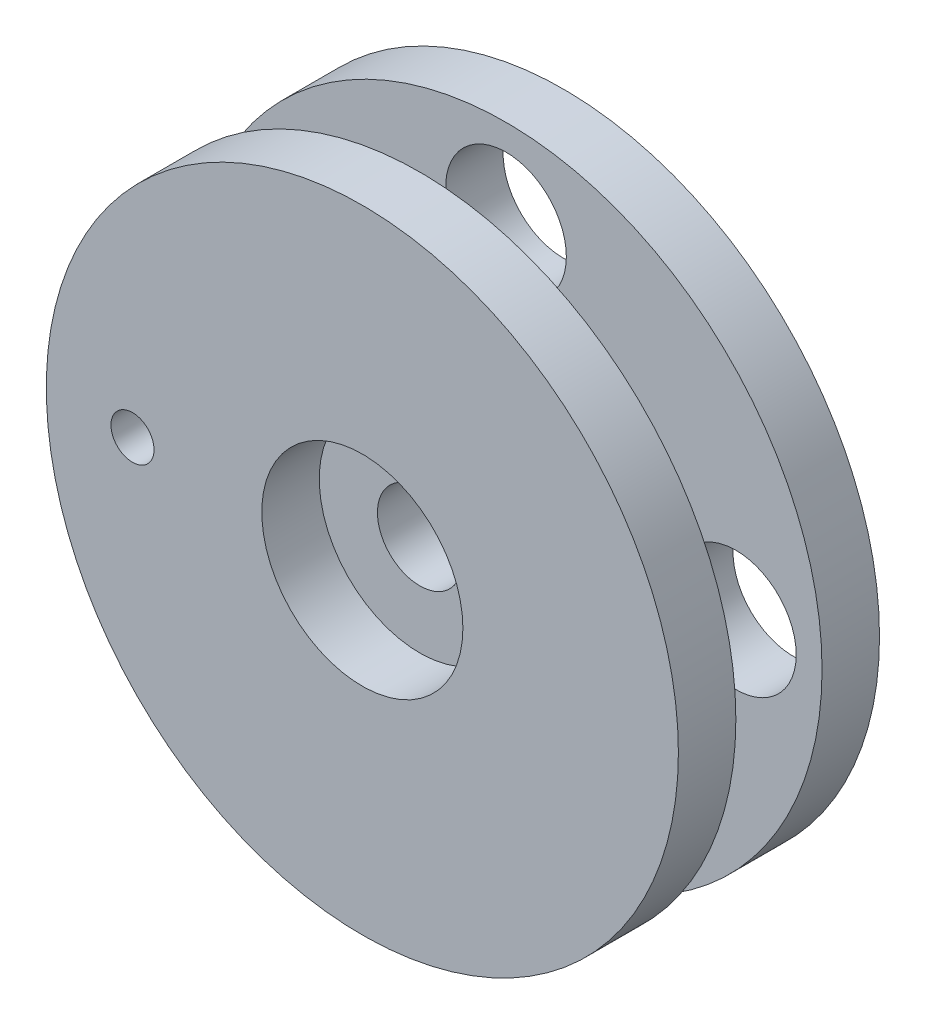
ISO-10303-21;
HEADER;
FILE_DESCRIPTION(('STEP AP214'),'2;1');
FILE_NAME('part.step','',(''),(''),'','','');
FILE_SCHEMA(('AUTOMOTIVE_DESIGN { 1 0 10303 214 1 1 1 1 }'));
ENDSEC;
DATA;
#1=APPLICATION_CONTEXT('core data for automotive mechanical design processes');
#2=APPLICATION_PROTOCOL_DEFINITION('international standard','automotive_design',2000,#1);
#3=PRODUCT_CONTEXT('',#1,'mechanical');
#4=PRODUCT('Part','Part','',(#3));
#5=PRODUCT_RELATED_PRODUCT_CATEGORY('part','',(#4));
#6=PRODUCT_DEFINITION_FORMATION('','',#4);
#7=PRODUCT_DEFINITION_CONTEXT('part definition',#1,'design');
#8=PRODUCT_DEFINITION('design','',#6,#7);
#9=PRODUCT_DEFINITION_SHAPE('','',#8);
#10=(LENGTH_UNIT() NAMED_UNIT(*) SI_UNIT(.MILLI.,.METRE.));
#11=(NAMED_UNIT(*) PLANE_ANGLE_UNIT() SI_UNIT($,.RADIAN.));
#12=(NAMED_UNIT(*) SI_UNIT($,.STERADIAN.) SOLID_ANGLE_UNIT());
#13=UNCERTAINTY_MEASURE_WITH_UNIT(LENGTH_MEASURE(1.E-05),#10,'distance_accuracy_value','');
#14=(GEOMETRIC_REPRESENTATION_CONTEXT(3) GLOBAL_UNCERTAINTY_ASSIGNED_CONTEXT((#13)) GLOBAL_UNIT_ASSIGNED_CONTEXT((#10,
#11,#12)) REPRESENTATION_CONTEXT('',''));
#15=CARTESIAN_POINT('',(0.,0.,0.));
#16=DIRECTION('',(0.,0.,1.));
#17=DIRECTION('',(1.,0.,0.));
#18=AXIS2_PLACEMENT_3D('',#15,#16,#17);
#19=CARTESIAN_POINT('',(0.,0.,2.));
#20=DIRECTION('',(0.,0.,1.));
#21=DIRECTION('',(1.,0.,0.));
#22=AXIS2_PLACEMENT_3D('',#19,#20,#21);
#23=PLANE('',#22);
#24=CARTESIAN_POINT('',(0.,-8.,2.));
#25=DIRECTION('',(0.,0.,1.));
#26=DIRECTION('',(1.,0.,0.));
#27=AXIS2_PLACEMENT_3D('',#24,#25,#26);
#28=CIRCLE('',#27,2.1);
#29=CARTESIAN_POINT('',(2.1,-8.,2.));
#30=VERTEX_POINT('',#29);
#31=EDGE_CURVE('E67',#30,#30,#28,.T.);
#32=ORIENTED_EDGE('',*,*,#31,.F.);
#33=EDGE_LOOP('',(#32));
#34=FACE_BOUND('',#33,.T.);
#35=CARTESIAN_POINT('',(0.,8.,2.));
#36=DIRECTION('',(0.,0.,1.));
#37=DIRECTION('',(1.,0.,0.));
#38=AXIS2_PLACEMENT_3D('',#35,#36,#37);
#39=CIRCLE('',#38,2.1);
#40=CARTESIAN_POINT('',(2.1,8.,2.));
#41=VERTEX_POINT('',#40);
#42=EDGE_CURVE('E55',#41,#41,#39,.T.);
#43=ORIENTED_EDGE('',*,*,#42,.F.);
#44=EDGE_LOOP('',(#43));
#45=FACE_BOUND('',#44,.T.);
#46=CARTESIAN_POINT('',(0.,0.,2.));
#47=DIRECTION('',(0.,0.,1.));
#48=DIRECTION('',(1.,0.,0.));
#49=AXIS2_PLACEMENT_3D('',#46,#47,#48);
#50=CIRCLE('',#49,11.);
#51=CARTESIAN_POINT('',(11.,0.,2.));
#52=VERTEX_POINT('',#51);
#53=EDGE_CURVE('E38',#52,#52,#50,.T.);
#54=ORIENTED_EDGE('',*,*,#53,.T.);
#55=EDGE_LOOP('',(#54));
#56=FACE_BOUND('',#55,.T.);
#57=CARTESIAN_POINT('',(-8.,0.,2.));
#58=DIRECTION('',(0.,0.,1.));
#59=DIRECTION('',(1.,0.,0.));
#60=AXIS2_PLACEMENT_3D('',#57,#58,#59);
#61=CIRCLE('',#60,2.1);
#62=CARTESIAN_POINT('',(-5.9,0.,2.));
#63=VERTEX_POINT('',#62);
#64=EDGE_CURVE('E51',#63,#63,#61,.T.);
#65=ORIENTED_EDGE('',*,*,#64,.F.);
#66=EDGE_LOOP('',(#65));
#67=FACE_BOUND('',#66,.T.);
#68=CARTESIAN_POINT('',(8.,0.,2.));
#69=DIRECTION('',(0.,0.,1.));
#70=DIRECTION('',(1.,0.,0.));
#71=AXIS2_PLACEMENT_3D('',#68,#69,#70);
#72=CIRCLE('',#71,2.1);
#73=CARTESIAN_POINT('',(10.1,0.,2.));
#74=VERTEX_POINT('',#73);
#75=EDGE_CURVE('E61',#74,#74,#72,.T.);
#76=ORIENTED_EDGE('',*,*,#75,.F.);
#77=EDGE_LOOP('',(#76));
#78=FACE_BOUND('',#77,.T.);
#79=CARTESIAN_POINT('',(0.,0.,2.));
#80=DIRECTION('',(0.,0.,1.));
#81=DIRECTION('',(1.,0.,0.));
#82=AXIS2_PLACEMENT_3D('',#79,#80,#81);
#83=CIRCLE('',#82,5.);
#84=CARTESIAN_POINT('',(5.,0.,2.));
#85=VERTEX_POINT('',#84);
#86=EDGE_CURVE('E76',#85,#85,#83,.T.);
#87=ORIENTED_EDGE('',*,*,#86,.F.);
#88=EDGE_LOOP('',(#87));
#89=FACE_BOUND('',#88,.T.);
#90=ADVANCED_FACE('F31',(#34,#45,#56,#67,#78,#89),#23,.T.);
#91=CARTESIAN_POINT('',(0.,0.,0.));
#92=DIRECTION('',(0.,0.,1.));
#93=DIRECTION('',(1.,0.,0.));
#94=AXIS2_PLACEMENT_3D('',#91,#92,#93);
#95=PLANE('',#94);
#96=CARTESIAN_POINT('',(8.,0.,0.));
#97=DIRECTION('',(0.,0.,1.));
#98=DIRECTION('',(1.,0.,0.));
#99=AXIS2_PLACEMENT_3D('',#96,#97,#98);
#100=CIRCLE('',#99,2.1);
#101=CARTESIAN_POINT('',(10.1,0.,0.));
#102=VERTEX_POINT('',#101);
#103=EDGE_CURVE('E64',#102,#102,#100,.T.);
#104=ORIENTED_EDGE('',*,*,#103,.T.);
#105=EDGE_LOOP('',(#104));
#106=FACE_BOUND('',#105,.T.);
#107=CARTESIAN_POINT('',(-8.,0.,0.));
#108=DIRECTION('',(0.,0.,1.));
#109=DIRECTION('',(1.,0.,0.));
#110=AXIS2_PLACEMENT_3D('',#107,#108,#109);
#111=CIRCLE('',#110,2.1);
#112=CARTESIAN_POINT('',(-5.9,0.,0.));
#113=VERTEX_POINT('',#112);
#114=EDGE_CURVE('E52',#113,#113,#111,.T.);
#115=ORIENTED_EDGE('',*,*,#114,.T.);
#116=EDGE_LOOP('',(#115));
#117=FACE_BOUND('',#116,.T.);
#118=CARTESIAN_POINT('',(0.,0.,0.));
#119=DIRECTION('',(0.,0.,1.));
#120=DIRECTION('',(1.,0.,0.));
#121=AXIS2_PLACEMENT_3D('',#118,#119,#120);
#122=CIRCLE('',#121,11.);
#123=CARTESIAN_POINT('',(11.,0.,0.));
#124=VERTEX_POINT('',#123);
#125=EDGE_CURVE('E42',#124,#124,#122,.T.);
#126=ORIENTED_EDGE('',*,*,#125,.F.);
#127=EDGE_LOOP('',(#126));
#128=FACE_BOUND('',#127,.T.);
#129=CARTESIAN_POINT('',(0.,0.,0.));
#130=DIRECTION('',(0.,0.,1.));
#131=DIRECTION('',(1.,0.,0.));
#132=AXIS2_PLACEMENT_3D('',#129,#130,#131);
#133=CIRCLE('',#132,1.475);
#134=CARTESIAN_POINT('',(1.475,0.,0.));
#135=VERTEX_POINT('',#134);
#136=EDGE_CURVE('E47',#135,#135,#133,.T.);
#137=ORIENTED_EDGE('',*,*,#136,.T.);
#138=EDGE_LOOP('',(#137));
#139=FACE_BOUND('',#138,.T.);
#140=CARTESIAN_POINT('',(0.,8.,0.));
#141=DIRECTION('',(0.,0.,1.));
#142=DIRECTION('',(1.,0.,0.));
#143=AXIS2_PLACEMENT_3D('',#140,#141,#142);
#144=CIRCLE('',#143,2.1);
#145=CARTESIAN_POINT('',(2.1,8.,0.));
#146=VERTEX_POINT('',#145);
#147=EDGE_CURVE('E58',#146,#146,#144,.T.);
#148=ORIENTED_EDGE('',*,*,#147,.T.);
#149=EDGE_LOOP('',(#148));
#150=FACE_BOUND('',#149,.T.);
#151=CARTESIAN_POINT('',(0.,-8.,0.));
#152=DIRECTION('',(0.,0.,1.));
#153=DIRECTION('',(1.,0.,0.));
#154=AXIS2_PLACEMENT_3D('',#151,#152,#153);
#155=CIRCLE('',#154,2.1);
#156=CARTESIAN_POINT('',(2.1,-8.,0.));
#157=VERTEX_POINT('',#156);
#158=EDGE_CURVE('E70',#157,#157,#155,.T.);
#159=ORIENTED_EDGE('',*,*,#158,.T.);
#160=EDGE_LOOP('',(#159));
#161=FACE_BOUND('',#160,.T.);
#162=ADVANCED_FACE('F123',(#106,#117,#128,#139,#150,#161),#95,.F.);
#163=CARTESIAN_POINT('',(0.,0.,2.));
#164=DIRECTION('',(0.,0.,-1.));
#165=DIRECTION('',(-1.,0.,0.));
#166=AXIS2_PLACEMENT_3D('',#163,#164,#165);
#167=CYLINDRICAL_SURFACE('',#166,11.);
#168=ORIENTED_EDGE('',*,*,#53,.F.);
#169=EDGE_LOOP('',(#168));
#170=FACE_BOUND('',#169,.T.);
#171=ORIENTED_EDGE('',*,*,#125,.T.);
#172=EDGE_LOOP('',(#171));
#173=FACE_BOUND('',#172,.T.);
#174=ADVANCED_FACE('F33',(#170,#173),#167,.T.);
#175=CARTESIAN_POINT('',(0.,0.,2.));
#176=DIRECTION('',(0.,0.,-1.));
#177=DIRECTION('',(-1.,0.,0.));
#178=AXIS2_PLACEMENT_3D('',#175,#176,#177);
#179=CYLINDRICAL_SURFACE('',#178,1.475);
#180=ORIENTED_EDGE('',*,*,#136,.F.);
#181=EDGE_LOOP('',(#180));
#182=FACE_BOUND('',#181,.T.);
#183=CARTESIAN_POINT('',(0.,0.,5.));
#184=DIRECTION('',(0.,0.,1.));
#185=DIRECTION('',(1.,0.,0.));
#186=AXIS2_PLACEMENT_3D('',#183,#184,#185);
#187=CIRCLE('',#186,1.475);
#188=CARTESIAN_POINT('',(1.475,0.,5.));
#189=VERTEX_POINT('',#188);
#190=EDGE_CURVE('E79',#189,#189,#187,.T.);
#191=ORIENTED_EDGE('',*,*,#190,.T.);
#192=EDGE_LOOP('',(#191));
#193=FACE_BOUND('',#192,.T.);
#194=ADVANCED_FACE('F133',(#182,#193),#179,.F.);
#195=CARTESIAN_POINT('',(-8.,0.,2.));
#196=DIRECTION('',(0.,0.,-1.));
#197=DIRECTION('',(-1.,0.,0.));
#198=AXIS2_PLACEMENT_3D('',#195,#196,#197);
#199=CYLINDRICAL_SURFACE('',#198,2.1);
#200=ORIENTED_EDGE('',*,*,#64,.T.);
#201=EDGE_LOOP('',(#200));
#202=FACE_BOUND('',#201,.T.);
#203=ORIENTED_EDGE('',*,*,#114,.F.);
#204=EDGE_LOOP('',(#203));
#205=FACE_BOUND('',#204,.T.);
#206=ADVANCED_FACE('F136',(#202,#205),#199,.F.);
#207=CARTESIAN_POINT('',(0.,8.,2.));
#208=DIRECTION('',(0.,0.,-1.));
#209=DIRECTION('',(-1.,0.,0.));
#210=AXIS2_PLACEMENT_3D('',#207,#208,#209);
#211=CYLINDRICAL_SURFACE('',#210,2.1);
#212=ORIENTED_EDGE('',*,*,#42,.T.);
#213=EDGE_LOOP('',(#212));
#214=FACE_BOUND('',#213,.T.);
#215=ORIENTED_EDGE('',*,*,#147,.F.);
#216=EDGE_LOOP('',(#215));
#217=FACE_BOUND('',#216,.T.);
#218=ADVANCED_FACE('F140',(#214,#217),#211,.F.);
#219=CARTESIAN_POINT('',(8.,0.,2.));
#220=DIRECTION('',(0.,0.,-1.));
#221=DIRECTION('',(-1.,0.,0.));
#222=AXIS2_PLACEMENT_3D('',#219,#220,#221);
#223=CYLINDRICAL_SURFACE('',#222,2.1);
#224=ORIENTED_EDGE('',*,*,#75,.T.);
#225=EDGE_LOOP('',(#224));
#226=FACE_BOUND('',#225,.T.);
#227=ORIENTED_EDGE('',*,*,#103,.F.);
#228=EDGE_LOOP('',(#227));
#229=FACE_BOUND('',#228,.T.);
#230=ADVANCED_FACE('F144',(#226,#229),#223,.F.);
#231=CARTESIAN_POINT('',(0.,-8.,2.));
#232=DIRECTION('',(0.,0.,-1.));
#233=DIRECTION('',(-1.,0.,0.));
#234=AXIS2_PLACEMENT_3D('',#231,#232,#233);
#235=CYLINDRICAL_SURFACE('',#234,2.1);
#236=ORIENTED_EDGE('',*,*,#31,.T.);
#237=EDGE_LOOP('',(#236));
#238=FACE_BOUND('',#237,.T.);
#239=ORIENTED_EDGE('',*,*,#158,.F.);
#240=EDGE_LOOP('',(#239));
#241=FACE_BOUND('',#240,.T.);
#242=ADVANCED_FACE('F148',(#238,#241),#235,.F.);
#243=CARTESIAN_POINT('',(0.,0.,5.));
#244=DIRECTION('',(0.,0.,1.));
#245=DIRECTION('',(1.,0.,0.));
#246=AXIS2_PLACEMENT_3D('',#243,#244,#245);
#247=PLANE('',#246);
#248=CARTESIAN_POINT('',(0.,0.,5.));
#249=DIRECTION('',(0.,0.,1.));
#250=DIRECTION('',(1.,0.,0.));
#251=AXIS2_PLACEMENT_3D('',#248,#249,#250);
#252=CIRCLE('',#251,3.5);
#253=CARTESIAN_POINT('',(3.5,0.,5.));
#254=VERTEX_POINT('',#253);
#255=EDGE_CURVE('E10',#254,#254,#252,.F.);
#256=ORIENTED_EDGE('',*,*,#255,.F.);
#257=EDGE_LOOP('',(#256));
#258=FACE_BOUND('',#257,.T.);
#259=ORIENTED_EDGE('',*,*,#190,.F.);
#260=EDGE_LOOP('',(#259));
#261=FACE_BOUND('',#260,.T.);
#262=ADVANCED_FACE('F152',(#258,#261),#247,.T.);
#263=CARTESIAN_POINT('',(0.,0.,5.));
#264=DIRECTION('',(0.,0.,-1.));
#265=DIRECTION('',(-1.,0.,0.));
#266=AXIS2_PLACEMENT_3D('',#263,#264,#265);
#267=CYLINDRICAL_SURFACE('',#266,5.);
#268=CARTESIAN_POINT('',(0.,0.,5.));
#269=DIRECTION('',(0.,0.,1.));
#270=DIRECTION('',(1.,0.,0.));
#271=AXIS2_PLACEMENT_3D('',#268,#269,#270);
#272=CIRCLE('',#271,5.);
#273=CARTESIAN_POINT('',(5.,0.,5.));
#274=VERTEX_POINT('',#273);
#275=EDGE_CURVE('E73',#274,#274,#272,.T.);
#276=ORIENTED_EDGE('',*,*,#275,.F.);
#277=EDGE_LOOP('',(#276));
#278=FACE_BOUND('',#277,.T.);
#279=ORIENTED_EDGE('',*,*,#86,.T.);
#280=EDGE_LOOP('',(#279));
#281=FACE_BOUND('',#280,.T.);
#282=ADVANCED_FACE('F116',(#278,#281),#267,.T.);
#283=CARTESIAN_POINT('',(0.,0.,5.));
#284=DIRECTION('',(0.,0.,1.));
#285=DIRECTION('',(1.,0.,0.));
#286=AXIS2_PLACEMENT_3D('',#283,#284,#285);
#287=PLANE('',#286);
#288=CARTESIAN_POINT('',(-8.,0.,5.));
#289=DIRECTION('',(0.,0.,1.));
#290=DIRECTION('',(1.,0.,0.));
#291=AXIS2_PLACEMENT_3D('',#288,#289,#290);
#292=CIRCLE('',#291,0.75);
#293=CARTESIAN_POINT('',(-7.25,0.,5.));
#294=VERTEX_POINT('',#293);
#295=EDGE_CURVE('E94',#294,#294,#292,.T.);
#296=ORIENTED_EDGE('',*,*,#295,.T.);
#297=EDGE_LOOP('',(#296));
#298=FACE_BOUND('',#297,.T.);
#299=CARTESIAN_POINT('',(0.,0.,5.));
#300=DIRECTION('',(0.,0.,1.));
#301=DIRECTION('',(1.,0.,0.));
#302=AXIS2_PLACEMENT_3D('',#299,#300,#301);
#303=CIRCLE('',#302,11.);
#304=CARTESIAN_POINT('',(11.,0.,5.));
#305=VERTEX_POINT('',#304);
#306=EDGE_CURVE('E85',#305,#305,#303,.T.);
#307=ORIENTED_EDGE('',*,*,#306,.F.);
#308=EDGE_LOOP('',(#307));
#309=FACE_BOUND('',#308,.T.);
#310=ORIENTED_EDGE('',*,*,#275,.T.);
#311=EDGE_LOOP('',(#310));
#312=FACE_BOUND('',#311,.T.);
#313=ADVANCED_FACE('F106',(#298,#309,#312),#287,.F.);
#314=CARTESIAN_POINT('',(0.,0.,7.));
#315=DIRECTION('',(0.,0.,1.));
#316=DIRECTION('',(1.,0.,0.));
#317=AXIS2_PLACEMENT_3D('',#314,#315,#316);
#318=PLANE('',#317);
#319=CARTESIAN_POINT('',(0.,0.,7.));
#320=DIRECTION('',(0.,0.,1.));
#321=DIRECTION('',(1.,0.,0.));
#322=AXIS2_PLACEMENT_3D('',#319,#320,#321);
#323=CIRCLE('',#322,3.5);
#324=CARTESIAN_POINT('',(3.5,0.,7.));
#325=VERTEX_POINT('',#324);
#326=EDGE_CURVE('E88',#325,#325,#323,.T.);
#327=ORIENTED_EDGE('',*,*,#326,.F.);
#328=EDGE_LOOP('',(#327));
#329=FACE_BOUND('',#328,.T.);
#330=CARTESIAN_POINT('',(0.,0.,7.));
#331=DIRECTION('',(0.,0.,1.));
#332=DIRECTION('',(1.,0.,0.));
#333=AXIS2_PLACEMENT_3D('',#330,#331,#332);
#334=CIRCLE('',#333,11.);
#335=CARTESIAN_POINT('',(11.,0.,7.));
#336=VERTEX_POINT('',#335);
#337=EDGE_CURVE('E84',#336,#336,#334,.T.);
#338=ORIENTED_EDGE('',*,*,#337,.T.);
#339=EDGE_LOOP('',(#338));
#340=FACE_BOUND('',#339,.T.);
#341=CARTESIAN_POINT('',(-8.,0.,7.));
#342=DIRECTION('',(0.,0.,1.));
#343=DIRECTION('',(1.,0.,0.));
#344=AXIS2_PLACEMENT_3D('',#341,#342,#343);
#345=CIRCLE('',#344,0.75);
#346=CARTESIAN_POINT('',(-7.25,0.,7.));
#347=VERTEX_POINT('',#346);
#348=EDGE_CURVE('E93',#347,#347,#345,.T.);
#349=ORIENTED_EDGE('',*,*,#348,.F.);
#350=EDGE_LOOP('',(#349));
#351=FACE_BOUND('',#350,.T.);
#352=ADVANCED_FACE('F103',(#329,#340,#351),#318,.T.);
#353=CARTESIAN_POINT('',(0.,0.,7.));
#354=DIRECTION('',(0.,0.,-1.));
#355=DIRECTION('',(-1.,0.,0.));
#356=AXIS2_PLACEMENT_3D('',#353,#354,#355);
#357=CYLINDRICAL_SURFACE('',#356,11.);
#358=ORIENTED_EDGE('',*,*,#337,.F.);
#359=EDGE_LOOP('',(#358));
#360=FACE_BOUND('',#359,.T.);
#361=ORIENTED_EDGE('',*,*,#306,.T.);
#362=EDGE_LOOP('',(#361));
#363=FACE_BOUND('',#362,.T.);
#364=ADVANCED_FACE('F105',(#360,#363),#357,.T.);
#365=CARTESIAN_POINT('',(0.,0.,7.));
#366=DIRECTION('',(0.,0.,-1.));
#367=DIRECTION('',(-1.,0.,0.));
#368=AXIS2_PLACEMENT_3D('',#365,#366,#367);
#369=CYLINDRICAL_SURFACE('',#368,3.5);
#370=ORIENTED_EDGE('',*,*,#326,.T.);
#371=EDGE_LOOP('',(#370));
#372=FACE_BOUND('',#371,.T.);
#373=ORIENTED_EDGE('',*,*,#255,.T.);
#374=EDGE_LOOP('',(#373));
#375=FACE_BOUND('',#374,.T.);
#376=ADVANCED_FACE('F113',(#372,#375),#369,.F.);
#377=CARTESIAN_POINT('',(-8.,0.,7.));
#378=DIRECTION('',(0.,0.,-1.));
#379=DIRECTION('',(-1.,0.,0.));
#380=AXIS2_PLACEMENT_3D('',#377,#378,#379);
#381=CYLINDRICAL_SURFACE('',#380,0.75);
#382=ORIENTED_EDGE('',*,*,#348,.T.);
#383=EDGE_LOOP('',(#382));
#384=FACE_BOUND('',#383,.T.);
#385=ORIENTED_EDGE('',*,*,#295,.F.);
#386=EDGE_LOOP('',(#385));
#387=FACE_BOUND('',#386,.T.);
#388=ADVANCED_FACE('F100',(#384,#387),#381,.F.);
#389=CLOSED_SHELL('',(#90,#162,#174,#194,#206,#218,#230,#242,#262,#282,#313,#352,#364,#376,#388));
#390=MANIFOLD_SOLID_BREP('B2',#389);
#391=ADVANCED_BREP_SHAPE_REPRESENTATION('',(#18,#390),#14);
#392=SHAPE_DEFINITION_REPRESENTATION(#9,#391);
ENDSEC;
END-ISO-10303-21;
